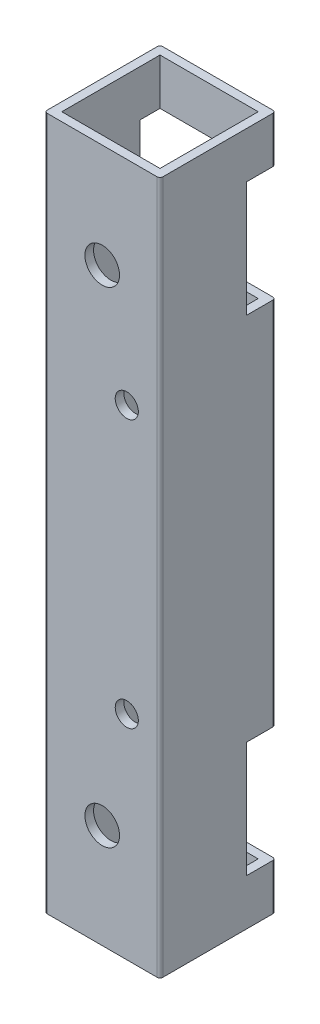
ISO-10303-21;
HEADER;
FILE_DESCRIPTION(('STEP AP214'),'2;1');
FILE_NAME('part.step','',(''),(''),'','','');
FILE_SCHEMA(('AUTOMOTIVE_DESIGN { 1 0 10303 214 1 1 1 1 }'));
ENDSEC;
DATA;
#1=APPLICATION_CONTEXT('core data for automotive mechanical design processes');
#2=APPLICATION_PROTOCOL_DEFINITION('international standard','automotive_design',2000,#1);
#3=PRODUCT_CONTEXT('',#1,'mechanical');
#4=PRODUCT('Part','Part','',(#3));
#5=PRODUCT_RELATED_PRODUCT_CATEGORY('part','',(#4));
#6=PRODUCT_DEFINITION_FORMATION('','',#4);
#7=PRODUCT_DEFINITION_CONTEXT('part definition',#1,'design');
#8=PRODUCT_DEFINITION('design','',#6,#7);
#9=PRODUCT_DEFINITION_SHAPE('','',#8);
#10=(LENGTH_UNIT() NAMED_UNIT(*) SI_UNIT(.MILLI.,.METRE.));
#11=(NAMED_UNIT(*) PLANE_ANGLE_UNIT() SI_UNIT($,.RADIAN.));
#12=(NAMED_UNIT(*) SI_UNIT($,.STERADIAN.) SOLID_ANGLE_UNIT());
#13=UNCERTAINTY_MEASURE_WITH_UNIT(LENGTH_MEASURE(1.E-05),#10,'distance_accuracy_value','');
#14=(GEOMETRIC_REPRESENTATION_CONTEXT(3) GLOBAL_UNCERTAINTY_ASSIGNED_CONTEXT((#13)) GLOBAL_UNIT_ASSIGNED_CONTEXT((#10,
#11,#12)) REPRESENTATION_CONTEXT('',''));
#15=CARTESIAN_POINT('',(0.,0.,0.));
#16=DIRECTION('',(0.,0.,1.));
#17=DIRECTION('',(1.,0.,0.));
#18=AXIS2_PLACEMENT_3D('',#15,#16,#17);
#19=CARTESIAN_POINT('',(19.5,120.,-19.5));
#20=DIRECTION('',(0.,-1.,0.));
#21=DIRECTION('',(0.,0.,-1.));
#22=AXIS2_PLACEMENT_3D('',#19,#20,#21);
#23=CYLINDRICAL_SURFACE('',#22,0.5);
#24=DIRECTION('',(0.,-1.,0.));
#25=VECTOR('',#24,1.);
#26=CARTESIAN_POINT('',(19.5,120.,-20.));
#27=LINE('',#26,#25);
#28=CARTESIAN_POINT('',(19.5,92.,-20.));
#29=VERTEX_POINT('',#28);
#30=CARTESIAN_POINT('',(19.5,28.,-20.));
#31=VERTEX_POINT('',#30);
#32=EDGE_CURVE('E530',#29,#31,#27,.T.);
#33=ORIENTED_EDGE('',*,*,#32,.F.);
#34=CARTESIAN_POINT('',(19.5,92.,-19.5));
#35=DIRECTION('',(0.,-1.,0.));
#36=DIRECTION('',(0.,0.,-1.));
#37=AXIS2_PLACEMENT_3D('',#34,#35,#36);
#38=CIRCLE('',#37,0.5);
#39=CARTESIAN_POINT('',(20.,92.,-19.5));
#40=VERTEX_POINT('',#39);
#41=EDGE_CURVE('E390',#29,#40,#38,.T.);
#42=ORIENTED_EDGE('',*,*,#41,.T.);
#43=DIRECTION('',(0.,-1.,0.));
#44=VECTOR('',#43,1.);
#45=CARTESIAN_POINT('',(20.,120.,-19.5));
#46=LINE('',#45,#44);
#47=CARTESIAN_POINT('',(20.,28.,-19.5));
#48=VERTEX_POINT('',#47);
#49=EDGE_CURVE('E536',#40,#48,#46,.T.);
#50=ORIENTED_EDGE('',*,*,#49,.T.);
#51=CARTESIAN_POINT('',(19.5,28.,-19.5));
#52=DIRECTION('',(0.,1.,0.));
#53=DIRECTION('',(0.,0.,1.));
#54=AXIS2_PLACEMENT_3D('',#51,#52,#53);
#55=CIRCLE('',#54,0.5);
#56=EDGE_CURVE('E350',#48,#31,#55,.T.);
#57=ORIENTED_EDGE('',*,*,#56,.T.);
#58=EDGE_LOOP('',(#33,#42,#50,#57));
#59=FACE_BOUND('',#58,.T.);
#60=ADVANCED_FACE('F39',(#59),#23,.T.);
#61=CARTESIAN_POINT('',(19.5,8.00000000000001,-20.));
#62=VERTEX_POINT('',#61);
#63=CARTESIAN_POINT('',(19.5,0.,-20.));
#64=VERTEX_POINT('',#63);
#65=EDGE_CURVE('E523',#62,#64,#27,.T.);
#66=ORIENTED_EDGE('',*,*,#65,.F.);
#67=CARTESIAN_POINT('',(19.5,8.00000000000001,-19.5));
#68=DIRECTION('',(0.,-1.,0.));
#69=DIRECTION('',(0.,0.,-1.));
#70=AXIS2_PLACEMENT_3D('',#67,#68,#69);
#71=CIRCLE('',#70,0.5);
#72=CARTESIAN_POINT('',(20.,8.00000000000001,-19.5));
#73=VERTEX_POINT('',#72);
#74=EDGE_CURVE('E364',#62,#73,#71,.T.);
#75=ORIENTED_EDGE('',*,*,#74,.T.);
#76=CARTESIAN_POINT('',(20.,0.,-19.5));
#77=VERTEX_POINT('',#76);
#78=EDGE_CURVE('E529',#73,#77,#46,.T.);
#79=ORIENTED_EDGE('',*,*,#78,.T.);
#80=CARTESIAN_POINT('',(19.5,0.,-19.5));
#81=DIRECTION('',(0.,1.,0.));
#82=DIRECTION('',(0.,0.,-1.));
#83=AXIS2_PLACEMENT_3D('',#80,#81,#82);
#84=CIRCLE('',#83,0.5);
#85=EDGE_CURVE('E482',#77,#64,#84,.T.);
#86=ORIENTED_EDGE('',*,*,#85,.T.);
#87=EDGE_LOOP('',(#66,#75,#79,#86));
#88=FACE_BOUND('',#87,.T.);
#89=ADVANCED_FACE('F637',(#88),#23,.T.);
#90=CARTESIAN_POINT('',(0.5,120.,-20.));
#91=DIRECTION('',(0.,0.,1.));
#92=DIRECTION('',(1.,0.,0.));
#93=AXIS2_PLACEMENT_3D('',#90,#91,#92);
#94=PLANE('',#93);
#95=DIRECTION('',(0.,-1.,0.));
#96=VECTOR('',#95,1.);
#97=CARTESIAN_POINT('',(0.5,120.,-20.));
#98=LINE('',#97,#96);
#99=CARTESIAN_POINT('',(0.5,92.,-20.));
#100=VERTEX_POINT('',#99);
#101=CARTESIAN_POINT('',(0.5,28.,-20.));
#102=VERTEX_POINT('',#101);
#103=EDGE_CURVE('E524',#100,#102,#98,.T.);
#104=ORIENTED_EDGE('',*,*,#103,.F.);
#105=DIRECTION('',(1.,0.,0.));
#106=VECTOR('',#105,1.);
#107=CARTESIAN_POINT('',(0.,92.,-20.));
#108=LINE('',#107,#106);
#109=EDGE_CURVE('E258',#100,#29,#108,.T.);
#110=ORIENTED_EDGE('',*,*,#109,.T.);
#111=ORIENTED_EDGE('',*,*,#32,.T.);
#112=DIRECTION('',(1.,0.,0.));
#113=VECTOR('',#112,1.);
#114=CARTESIAN_POINT('',(0.,28.,-20.));
#115=LINE('',#114,#113);
#116=EDGE_CURVE('E335',#102,#31,#115,.T.);
#117=ORIENTED_EDGE('',*,*,#116,.F.);
#118=EDGE_LOOP('',(#104,#110,#111,#117));
#119=FACE_BOUND('',#118,.T.);
#120=ADVANCED_FACE('F657',(#119),#94,.F.);
#121=CARTESIAN_POINT('',(0.5,8.00000000000001,-20.));
#122=VERTEX_POINT('',#121);
#123=CARTESIAN_POINT('',(0.5,0.,-20.));
#124=VERTEX_POINT('',#123);
#125=EDGE_CURVE('E517',#122,#124,#98,.T.);
#126=ORIENTED_EDGE('',*,*,#125,.F.);
#127=DIRECTION('',(1.,0.,0.));
#128=VECTOR('',#127,1.);
#129=CARTESIAN_POINT('',(0.,8.00000000000001,-20.));
#130=LINE('',#129,#128);
#131=EDGE_CURVE('E315',#122,#62,#130,.T.);
#132=ORIENTED_EDGE('',*,*,#131,.T.);
#133=ORIENTED_EDGE('',*,*,#65,.T.);
#134=DIRECTION('',(-1.,0.,0.));
#135=VECTOR('',#134,1.);
#136=CARTESIAN_POINT('',(0.5,0.,-20.));
#137=LINE('',#136,#135);
#138=EDGE_CURVE('E486',#64,#124,#137,.T.);
#139=ORIENTED_EDGE('',*,*,#138,.T.);
#140=EDGE_LOOP('',(#126,#132,#133,#139));
#141=FACE_BOUND('',#140,.T.);
#142=ADVANCED_FACE('F633',(#141),#94,.F.);
#143=CARTESIAN_POINT('',(0.5,120.,-19.5));
#144=DIRECTION('',(0.,-1.,0.));
#145=DIRECTION('',(0.,0.,-1.));
#146=AXIS2_PLACEMENT_3D('',#143,#144,#145);
#147=CYLINDRICAL_SURFACE('',#146,0.5);
#148=DIRECTION('',(0.,-1.,0.));
#149=VECTOR('',#148,1.);
#150=CARTESIAN_POINT('',(0.,120.,-19.5));
#151=LINE('',#150,#149);
#152=CARTESIAN_POINT('',(0.,92.,-19.5));
#153=VERTEX_POINT('',#152);
#154=CARTESIAN_POINT('',(0.,28.,-19.5));
#155=VERTEX_POINT('',#154);
#156=EDGE_CURVE('E518',#153,#155,#151,.T.);
#157=ORIENTED_EDGE('',*,*,#156,.F.);
#158=CARTESIAN_POINT('',(0.5,92.,-19.5));
#159=DIRECTION('',(0.,-1.,0.));
#160=DIRECTION('',(0.,0.,-1.));
#161=AXIS2_PLACEMENT_3D('',#158,#159,#160);
#162=CIRCLE('',#161,0.5);
#163=EDGE_CURVE('E265',#153,#100,#162,.T.);
#164=ORIENTED_EDGE('',*,*,#163,.T.);
#165=ORIENTED_EDGE('',*,*,#103,.T.);
#166=CARTESIAN_POINT('',(0.5,28.,-19.5));
#167=DIRECTION('',(0.,1.,0.));
#168=DIRECTION('',(0.,0.,1.));
#169=AXIS2_PLACEMENT_3D('',#166,#167,#168);
#170=CIRCLE('',#169,0.5);
#171=EDGE_CURVE('E346',#102,#155,#170,.T.);
#172=ORIENTED_EDGE('',*,*,#171,.T.);
#173=EDGE_LOOP('',(#157,#164,#165,#172));
#174=FACE_BOUND('',#173,.T.);
#175=ADVANCED_FACE('F659',(#174),#147,.T.);
#176=CARTESIAN_POINT('',(0.,8.00000000000001,-19.5));
#177=VERTEX_POINT('',#176);
#178=CARTESIAN_POINT('',(0.,0.,-19.5));
#179=VERTEX_POINT('',#178);
#180=EDGE_CURVE('E513',#177,#179,#151,.T.);
#181=ORIENTED_EDGE('',*,*,#180,.F.);
#182=CARTESIAN_POINT('',(0.5,8.00000000000001,-19.5));
#183=DIRECTION('',(0.,-1.,0.));
#184=DIRECTION('',(0.,0.,-1.));
#185=AXIS2_PLACEMENT_3D('',#182,#183,#184);
#186=CIRCLE('',#185,0.5);
#187=EDGE_CURVE('E360',#177,#122,#186,.T.);
#188=ORIENTED_EDGE('',*,*,#187,.T.);
#189=ORIENTED_EDGE('',*,*,#125,.T.);
#190=CARTESIAN_POINT('',(0.5,0.,-19.5));
#191=DIRECTION('',(0.,1.,0.));
#192=DIRECTION('',(0.,0.,-1.));
#193=AXIS2_PLACEMENT_3D('',#190,#191,#192);
#194=CIRCLE('',#193,0.5);
#195=EDGE_CURVE('E490',#124,#179,#194,.T.);
#196=ORIENTED_EDGE('',*,*,#195,.T.);
#197=EDGE_LOOP('',(#181,#188,#189,#196));
#198=FACE_BOUND('',#197,.T.);
#199=ADVANCED_FACE('F629',(#198),#147,.T.);
#200=CARTESIAN_POINT('',(1.5,120.,-18.5));
#201=DIRECTION('',(0.,0.,1.));
#202=DIRECTION('',(1.,0.,0.));
#203=AXIS2_PLACEMENT_3D('',#200,#201,#202);
#204=PLANE('',#203);
#205=DIRECTION('',(1.,0.,0.));
#206=VECTOR('',#205,1.);
#207=CARTESIAN_POINT('',(1.5,92.,-18.5));
#208=LINE('',#207,#206);
#209=CARTESIAN_POINT('',(1.5,92.,-18.5));
#210=VERTEX_POINT('',#209);
#211=CARTESIAN_POINT('',(18.5,92.,-18.5));
#212=VERTEX_POINT('',#211);
#213=EDGE_CURVE('E549',#210,#212,#208,.T.);
#214=ORIENTED_EDGE('',*,*,#213,.F.);
#215=DIRECTION('',(0.,-1.,0.));
#216=VECTOR('',#215,1.);
#217=CARTESIAN_POINT('',(1.5,120.,-18.5));
#218=LINE('',#217,#216);
#219=CARTESIAN_POINT('',(1.5,28.,-18.5));
#220=VERTEX_POINT('',#219);
#221=EDGE_CURVE('E434',#210,#220,#218,.T.);
#222=ORIENTED_EDGE('',*,*,#221,.T.);
#223=DIRECTION('',(-1.,0.,0.));
#224=VECTOR('',#223,1.);
#225=CARTESIAN_POINT('',(1.5,28.,-18.5));
#226=LINE('',#225,#224);
#227=CARTESIAN_POINT('',(18.5,28.,-18.5));
#228=VERTEX_POINT('',#227);
#229=EDGE_CURVE('E540',#228,#220,#226,.T.);
#230=ORIENTED_EDGE('',*,*,#229,.F.);
#231=DIRECTION('',(0.,-1.,0.));
#232=VECTOR('',#231,1.);
#233=CARTESIAN_POINT('',(18.5,120.,-18.5));
#234=LINE('',#233,#232);
#235=EDGE_CURVE('E440',#212,#228,#234,.T.);
#236=ORIENTED_EDGE('',*,*,#235,.F.);
#237=EDGE_LOOP('',(#214,#222,#230,#236));
#238=FACE_BOUND('',#237,.T.);
#239=ADVANCED_FACE('F699',(#238),#204,.T.);
#240=DIRECTION('',(1.,0.,0.));
#241=VECTOR('',#240,1.);
#242=CARTESIAN_POINT('',(1.5,8.00000000000001,-18.5));
#243=LINE('',#242,#241);
#244=CARTESIAN_POINT('',(1.5,8.00000000000001,-18.5));
#245=VERTEX_POINT('',#244);
#246=CARTESIAN_POINT('',(18.5,8.00000000000001,-18.5));
#247=VERTEX_POINT('',#246);
#248=EDGE_CURVE('E543',#245,#247,#243,.T.);
#249=ORIENTED_EDGE('',*,*,#248,.F.);
#250=CARTESIAN_POINT('',(1.5,0.,-18.5));
#251=VERTEX_POINT('',#250);
#252=EDGE_CURVE('E414',#245,#251,#218,.T.);
#253=ORIENTED_EDGE('',*,*,#252,.T.);
#254=DIRECTION('',(-1.,0.,0.));
#255=VECTOR('',#254,1.);
#256=CARTESIAN_POINT('',(1.5,0.,-18.5));
#257=LINE('',#256,#255);
#258=CARTESIAN_POINT('',(18.5,0.,-18.5));
#259=VERTEX_POINT('',#258);
#260=EDGE_CURVE('E404',#259,#251,#257,.T.);
#261=ORIENTED_EDGE('',*,*,#260,.F.);
#262=EDGE_CURVE('E433',#247,#259,#234,.T.);
#263=ORIENTED_EDGE('',*,*,#262,.F.);
#264=EDGE_LOOP('',(#249,#253,#261,#263));
#265=FACE_BOUND('',#264,.T.);
#266=ADVANCED_FACE('F725',(#265),#204,.T.);
#267=CARTESIAN_POINT('',(19.5,120.,-0.5));
#268=DIRECTION('',(0.,1.,0.));
#269=DIRECTION('',(0.,0.,1.));
#270=AXIS2_PLACEMENT_3D('',#267,#268,#269);
#271=PLANE('',#270);
#272=CARTESIAN_POINT('',(19.5,120.,-0.5));
#273=DIRECTION('',(0.,1.,0.));
#274=DIRECTION('',(0.,0.,1.));
#275=AXIS2_PLACEMENT_3D('',#272,#273,#274);
#276=CIRCLE('',#275,0.5);
#277=CARTESIAN_POINT('',(19.5,120.,0.));
#278=VERTEX_POINT('',#277);
#279=CARTESIAN_POINT('',(20.,120.,-0.5));
#280=VERTEX_POINT('',#279);
#281=EDGE_CURVE('E448',#278,#280,#276,.T.);
#282=ORIENTED_EDGE('',*,*,#281,.T.);
#283=DIRECTION('',(0.,0.,-1.));
#284=VECTOR('',#283,1.);
#285=CARTESIAN_POINT('',(20.,120.,-0.5));
#286=LINE('',#285,#284);
#287=CARTESIAN_POINT('',(20.,120.,-19.5));
#288=VERTEX_POINT('',#287);
#289=EDGE_CURVE('E452',#280,#288,#286,.T.);
#290=ORIENTED_EDGE('',*,*,#289,.T.);
#291=CARTESIAN_POINT('',(19.5,120.,-19.5));
#292=DIRECTION('',(0.,1.,0.));
#293=DIRECTION('',(0.,0.,-1.));
#294=AXIS2_PLACEMENT_3D('',#291,#292,#293);
#295=CIRCLE('',#294,0.5);
#296=CARTESIAN_POINT('',(19.5,120.,-20.));
#297=VERTEX_POINT('',#296);
#298=EDGE_CURVE('E456',#288,#297,#295,.T.);
#299=ORIENTED_EDGE('',*,*,#298,.T.);
#300=DIRECTION('',(-1.,0.,0.));
#301=VECTOR('',#300,1.);
#302=CARTESIAN_POINT('',(0.5,120.,-20.));
#303=LINE('',#302,#301);
#304=CARTESIAN_POINT('',(0.5,120.,-20.));
#305=VERTEX_POINT('',#304);
#306=EDGE_CURVE('E459',#297,#305,#303,.T.);
#307=ORIENTED_EDGE('',*,*,#306,.T.);
#308=CARTESIAN_POINT('',(0.5,120.,-19.5));
#309=DIRECTION('',(0.,1.,0.));
#310=DIRECTION('',(0.,0.,-1.));
#311=AXIS2_PLACEMENT_3D('',#308,#309,#310);
#312=CIRCLE('',#311,0.5);
#313=CARTESIAN_POINT('',(0.,120.,-19.5));
#314=VERTEX_POINT('',#313);
#315=EDGE_CURVE('E462',#305,#314,#312,.T.);
#316=ORIENTED_EDGE('',*,*,#315,.T.);
#317=DIRECTION('',(0.,0.,1.));
#318=VECTOR('',#317,1.);
#319=CARTESIAN_POINT('',(0.,120.,-0.500000000000004));
#320=LINE('',#319,#318);
#321=CARTESIAN_POINT('',(0.,120.,-0.500000000000003));
#322=VERTEX_POINT('',#321);
#323=EDGE_CURVE('E465',#314,#322,#320,.T.);
#324=ORIENTED_EDGE('',*,*,#323,.T.);
#325=CARTESIAN_POINT('',(0.5,120.,-0.5));
#326=DIRECTION('',(0.,1.,0.));
#327=DIRECTION('',(0.,0.,-1.));
#328=AXIS2_PLACEMENT_3D('',#325,#326,#327);
#329=CIRCLE('',#328,0.5);
#330=CARTESIAN_POINT('',(0.500000000000004,120.,0.));
#331=VERTEX_POINT('',#330);
#332=EDGE_CURVE('E468',#322,#331,#329,.T.);
#333=ORIENTED_EDGE('',*,*,#332,.T.);
#334=DIRECTION('',(1.,0.,0.));
#335=VECTOR('',#334,1.);
#336=CARTESIAN_POINT('',(0.500000000000004,120.,0.));
#337=LINE('',#336,#335);
#338=EDGE_CURVE('E471',#331,#278,#337,.T.);
#339=ORIENTED_EDGE('',*,*,#338,.T.);
#340=EDGE_LOOP('',(#282,#290,#299,#307,#316,#324,#333,#339));
#341=FACE_BOUND('',#340,.T.);
#342=DIRECTION('',(1.,0.,0.));
#343=VECTOR('',#342,1.);
#344=CARTESIAN_POINT('',(1.5,120.,-1.5));
#345=LINE('',#344,#343);
#346=CARTESIAN_POINT('',(1.5,120.,-1.5));
#347=VERTEX_POINT('',#346);
#348=CARTESIAN_POINT('',(18.5,120.,-1.5));
#349=VERTEX_POINT('',#348);
#350=EDGE_CURVE('E403',#347,#349,#345,.T.);
#351=ORIENTED_EDGE('',*,*,#350,.F.);
#352=DIRECTION('',(0.,0.,1.));
#353=VECTOR('',#352,1.);
#354=CARTESIAN_POINT('',(1.5,120.,-1.5));
#355=LINE('',#354,#353);
#356=CARTESIAN_POINT('',(1.5,120.,-18.5));
#357=VERTEX_POINT('',#356);
#358=EDGE_CURVE('E400',#357,#347,#355,.T.);
#359=ORIENTED_EDGE('',*,*,#358,.F.);
#360=DIRECTION('',(-1.,0.,0.));
#361=VECTOR('',#360,1.);
#362=CARTESIAN_POINT('',(1.5,120.,-18.5));
#363=LINE('',#362,#361);
#364=CARTESIAN_POINT('',(18.5,120.,-18.5));
#365=VERTEX_POINT('',#364);
#366=EDGE_CURVE('E411',#365,#357,#363,.T.);
#367=ORIENTED_EDGE('',*,*,#366,.F.);
#368=DIRECTION('',(0.,0.,-1.));
#369=VECTOR('',#368,1.);
#370=CARTESIAN_POINT('',(18.5,120.,-1.5));
#371=LINE('',#370,#369);
#372=EDGE_CURVE('E407',#349,#365,#371,.T.);
#373=ORIENTED_EDGE('',*,*,#372,.F.);
#374=EDGE_LOOP('',(#351,#359,#367,#373));
#375=FACE_BOUND('',#374,.T.);
#376=ADVANCED_FACE('F617',(#341,#375),#271,.T.);
#377=CARTESIAN_POINT('',(19.5,0.,-0.5));
#378=DIRECTION('',(0.,1.,0.));
#379=DIRECTION('',(0.,0.,1.));
#380=AXIS2_PLACEMENT_3D('',#377,#378,#379);
#381=PLANE('',#380);
#382=CARTESIAN_POINT('',(19.5,0.,-0.5));
#383=DIRECTION('',(0.,1.,0.));
#384=DIRECTION('',(0.,0.,1.));
#385=AXIS2_PLACEMENT_3D('',#382,#383,#384);
#386=CIRCLE('',#385,0.5);
#387=CARTESIAN_POINT('',(19.5,0.,0.));
#388=VERTEX_POINT('',#387);
#389=CARTESIAN_POINT('',(20.,0.,-0.5));
#390=VERTEX_POINT('',#389);
#391=EDGE_CURVE('E447',#388,#390,#386,.T.);
#392=ORIENTED_EDGE('',*,*,#391,.F.);
#393=DIRECTION('',(1.,0.,0.));
#394=VECTOR('',#393,1.);
#395=CARTESIAN_POINT('',(0.500000000000004,0.,0.));
#396=LINE('',#395,#394);
#397=CARTESIAN_POINT('',(0.500000000000004,0.,0.));
#398=VERTEX_POINT('',#397);
#399=EDGE_CURVE('E453',#398,#388,#396,.T.);
#400=ORIENTED_EDGE('',*,*,#399,.F.);
#401=CARTESIAN_POINT('',(0.5,0.,-0.5));
#402=DIRECTION('',(0.,1.,0.));
#403=DIRECTION('',(0.,0.,-1.));
#404=AXIS2_PLACEMENT_3D('',#401,#402,#403);
#405=CIRCLE('',#404,0.5);
#406=CARTESIAN_POINT('',(0.,0.,-0.500000000000003));
#407=VERTEX_POINT('',#406);
#408=EDGE_CURVE('E497',#407,#398,#405,.T.);
#409=ORIENTED_EDGE('',*,*,#408,.F.);
#410=DIRECTION('',(0.,0.,1.));
#411=VECTOR('',#410,1.);
#412=CARTESIAN_POINT('',(0.,0.,-0.500000000000004));
#413=LINE('',#412,#411);
#414=EDGE_CURVE('E494',#179,#407,#413,.T.);
#415=ORIENTED_EDGE('',*,*,#414,.F.);
#416=ORIENTED_EDGE('',*,*,#195,.F.);
#417=ORIENTED_EDGE('',*,*,#138,.F.);
#418=ORIENTED_EDGE('',*,*,#85,.F.);
#419=DIRECTION('',(0.,0.,-1.));
#420=VECTOR('',#419,1.);
#421=CARTESIAN_POINT('',(20.,0.,-0.5));
#422=LINE('',#421,#420);
#423=EDGE_CURVE('E478',#390,#77,#422,.T.);
#424=ORIENTED_EDGE('',*,*,#423,.F.);
#425=EDGE_LOOP('',(#392,#400,#409,#415,#416,#417,#418,#424));
#426=FACE_BOUND('',#425,.T.);
#427=DIRECTION('',(0.,0.,1.));
#428=VECTOR('',#427,1.);
#429=CARTESIAN_POINT('',(1.5,0.,-1.5));
#430=LINE('',#429,#428);
#431=CARTESIAN_POINT('',(1.5,0.,-1.5));
#432=VERTEX_POINT('',#431);
#433=EDGE_CURVE('E399',#251,#432,#430,.T.);
#434=ORIENTED_EDGE('',*,*,#433,.T.);
#435=DIRECTION('',(1.,0.,0.));
#436=VECTOR('',#435,1.);
#437=CARTESIAN_POINT('',(1.5,0.,-1.5));
#438=LINE('',#437,#436);
#439=CARTESIAN_POINT('',(18.5,0.,-1.5));
#440=VERTEX_POINT('',#439);
#441=EDGE_CURVE('E418',#432,#440,#438,.T.);
#442=ORIENTED_EDGE('',*,*,#441,.T.);
#443=DIRECTION('',(0.,0.,-1.));
#444=VECTOR('',#443,1.);
#445=CARTESIAN_POINT('',(18.5,0.,-1.5));
#446=LINE('',#445,#444);
#447=EDGE_CURVE('E422',#440,#259,#446,.T.);
#448=ORIENTED_EDGE('',*,*,#447,.T.);
#449=ORIENTED_EDGE('',*,*,#260,.T.);
#450=EDGE_LOOP('',(#434,#442,#448,#449));
#451=FACE_BOUND('',#450,.T.);
#452=ADVANCED_FACE('F605',(#426,#451),#381,.F.);
#453=CARTESIAN_POINT('',(19.5,120.,-0.5));
#454=DIRECTION('',(0.,-1.,0.));
#455=DIRECTION('',(0.,0.,-1.));
#456=AXIS2_PLACEMENT_3D('',#453,#454,#455);
#457=CYLINDRICAL_SURFACE('',#456,0.5);
#458=ORIENTED_EDGE('',*,*,#391,.T.);
#459=DIRECTION('',(0.,-1.,0.));
#460=VECTOR('',#459,1.);
#461=CARTESIAN_POINT('',(20.,120.,-0.5));
#462=LINE('',#461,#460);
#463=EDGE_CURVE('E535',#280,#390,#462,.T.);
#464=ORIENTED_EDGE('',*,*,#463,.F.);
#465=ORIENTED_EDGE('',*,*,#281,.F.);
#466=DIRECTION('',(0.,-1.,0.));
#467=VECTOR('',#466,1.);
#468=CARTESIAN_POINT('',(19.5,120.,0.));
#469=LINE('',#468,#467);
#470=EDGE_CURVE('E474',#278,#388,#469,.T.);
#471=ORIENTED_EDGE('',*,*,#470,.T.);
#472=EDGE_LOOP('',(#458,#464,#465,#471));
#473=FACE_BOUND('',#472,.T.);
#474=ADVANCED_FACE('F41',(#473),#457,.T.);
#475=CARTESIAN_POINT('',(20.,120.,-0.5));
#476=DIRECTION('',(-1.,0.,0.));
#477=DIRECTION('',(0.,0.,1.));
#478=AXIS2_PLACEMENT_3D('',#475,#476,#477);
#479=PLANE('',#478);
#480=ORIENTED_EDGE('',*,*,#49,.F.);
#481=DIRECTION('',(0.,0.,-1.));
#482=VECTOR('',#481,1.);
#483=CARTESIAN_POINT('',(20.,92.,-15.));
#484=LINE('',#483,#482);
#485=CARTESIAN_POINT('',(20.,92.,-15.));
#486=VERTEX_POINT('',#485);
#487=EDGE_CURVE('E279',#486,#40,#484,.T.);
#488=ORIENTED_EDGE('',*,*,#487,.F.);
#489=DIRECTION('',(0.,-1.,0.));
#490=VECTOR('',#489,1.);
#491=CARTESIAN_POINT('',(20.,112.,-15.));
#492=LINE('',#491,#490);
#493=CARTESIAN_POINT('',(20.,112.,-15.));
#494=VERTEX_POINT('',#493);
#495=EDGE_CURVE('E287',#494,#486,#492,.T.);
#496=ORIENTED_EDGE('',*,*,#495,.F.);
#497=DIRECTION('',(0.,0.,1.));
#498=VECTOR('',#497,1.);
#499=CARTESIAN_POINT('',(20.,112.,-20.));
#500=LINE('',#499,#498);
#501=CARTESIAN_POINT('',(20.,112.,-19.5));
#502=VERTEX_POINT('',#501);
#503=EDGE_CURVE('E283',#502,#494,#500,.T.);
#504=ORIENTED_EDGE('',*,*,#503,.F.);
#505=EDGE_CURVE('E531',#288,#502,#46,.T.);
#506=ORIENTED_EDGE('',*,*,#505,.F.);
#507=ORIENTED_EDGE('',*,*,#289,.F.);
#508=ORIENTED_EDGE('',*,*,#463,.T.);
#509=ORIENTED_EDGE('',*,*,#423,.T.);
#510=ORIENTED_EDGE('',*,*,#78,.F.);
#511=DIRECTION('',(0.,0.,-1.));
#512=VECTOR('',#511,1.);
#513=CARTESIAN_POINT('',(20.,8.00000000000001,-15.));
#514=LINE('',#513,#512);
#515=CARTESIAN_POINT('',(20.,8.00000000000001,-15.));
#516=VERTEX_POINT('',#515);
#517=EDGE_CURVE('E316',#516,#73,#514,.T.);
#518=ORIENTED_EDGE('',*,*,#517,.F.);
#519=DIRECTION('',(0.,-1.,0.));
#520=VECTOR('',#519,1.);
#521=CARTESIAN_POINT('',(20.,8.00000000000001,-15.));
#522=LINE('',#521,#520);
#523=CARTESIAN_POINT('',(20.,28.,-15.));
#524=VERTEX_POINT('',#523);
#525=EDGE_CURVE('E309',#524,#516,#522,.T.);
#526=ORIENTED_EDGE('',*,*,#525,.F.);
#527=DIRECTION('',(0.,0.,1.));
#528=VECTOR('',#527,1.);
#529=CARTESIAN_POINT('',(20.,28.,-15.));
#530=LINE('',#529,#528);
#531=EDGE_CURVE('E319',#48,#524,#530,.T.);
#532=ORIENTED_EDGE('',*,*,#531,.F.);
#533=EDGE_LOOP('',(#480,#488,#496,#504,#506,#507,#508,#509,#510,#518,#526,#532));
#534=FACE_BOUND('',#533,.T.);
#535=ADVANCED_FACE('F612',(#534),#479,.F.);
#536=ORIENTED_EDGE('',*,*,#505,.T.);
#537=CARTESIAN_POINT('',(19.5,112.,-19.5));
#538=DIRECTION('',(0.,1.,0.));
#539=DIRECTION('',(0.,0.,1.));
#540=AXIS2_PLACEMENT_3D('',#537,#538,#539);
#541=CIRCLE('',#540,0.5);
#542=CARTESIAN_POINT('',(19.5,112.,-20.));
#543=VERTEX_POINT('',#542);
#544=EDGE_CURVE('E378',#502,#543,#541,.T.);
#545=ORIENTED_EDGE('',*,*,#544,.T.);
#546=EDGE_CURVE('E525',#297,#543,#27,.T.);
#547=ORIENTED_EDGE('',*,*,#546,.F.);
#548=ORIENTED_EDGE('',*,*,#298,.F.);
#549=EDGE_LOOP('',(#536,#545,#547,#548));
#550=FACE_BOUND('',#549,.T.);
#551=ADVANCED_FACE('F679',(#550),#23,.T.);
#552=ORIENTED_EDGE('',*,*,#546,.T.);
#553=DIRECTION('',(1.,0.,0.));
#554=VECTOR('',#553,1.);
#555=CARTESIAN_POINT('',(0.,112.,-20.));
#556=LINE('',#555,#554);
#557=CARTESIAN_POINT('',(0.5,112.,-20.));
#558=VERTEX_POINT('',#557);
#559=EDGE_CURVE('E270',#558,#543,#556,.T.);
#560=ORIENTED_EDGE('',*,*,#559,.F.);
#561=EDGE_CURVE('E519',#305,#558,#98,.T.);
#562=ORIENTED_EDGE('',*,*,#561,.F.);
#563=ORIENTED_EDGE('',*,*,#306,.F.);
#564=EDGE_LOOP('',(#552,#560,#562,#563));
#565=FACE_BOUND('',#564,.T.);
#566=ADVANCED_FACE('F687',(#565),#94,.F.);
#567=ORIENTED_EDGE('',*,*,#561,.T.);
#568=CARTESIAN_POINT('',(0.5,112.,-19.5));
#569=DIRECTION('',(0.,1.,0.));
#570=DIRECTION('',(0.,0.,1.));
#571=AXIS2_PLACEMENT_3D('',#568,#569,#570);
#572=CIRCLE('',#571,0.5);
#573=CARTESIAN_POINT('',(0.,112.,-19.5));
#574=VERTEX_POINT('',#573);
#575=EDGE_CURVE('E374',#558,#574,#572,.T.);
#576=ORIENTED_EDGE('',*,*,#575,.T.);
#577=EDGE_CURVE('E514',#314,#574,#151,.T.);
#578=ORIENTED_EDGE('',*,*,#577,.F.);
#579=ORIENTED_EDGE('',*,*,#315,.F.);
#580=EDGE_LOOP('',(#567,#576,#578,#579));
#581=FACE_BOUND('',#580,.T.);
#582=ADVANCED_FACE('F689',(#581),#147,.T.);
#583=CARTESIAN_POINT('',(0.,120.,-0.500000000000004));
#584=DIRECTION('',(1.,0.,0.));
#585=DIRECTION('',(0.,0.,-1.));
#586=AXIS2_PLACEMENT_3D('',#583,#584,#585);
#587=PLANE('',#586);
#588=DIRECTION('',(0.,-1.,0.));
#589=VECTOR('',#588,1.);
#590=CARTESIAN_POINT('',(0.,112.,-15.));
#591=LINE('',#590,#589);
#592=CARTESIAN_POINT('',(0.,112.,-15.));
#593=VERTEX_POINT('',#592);
#594=CARTESIAN_POINT('',(0.,92.,-15.));
#595=VERTEX_POINT('',#594);
#596=EDGE_CURVE('E57',#593,#595,#591,.T.);
#597=ORIENTED_EDGE('',*,*,#596,.T.);
#598=DIRECTION('',(0.,0.,-1.));
#599=VECTOR('',#598,1.);
#600=CARTESIAN_POINT('',(0.,92.,-15.));
#601=LINE('',#600,#599);
#602=EDGE_CURVE('E262',#595,#153,#601,.T.);
#603=ORIENTED_EDGE('',*,*,#602,.T.);
#604=ORIENTED_EDGE('',*,*,#156,.T.);
#605=DIRECTION('',(0.,0.,1.));
#606=VECTOR('',#605,1.);
#607=CARTESIAN_POINT('',(0.,28.,-15.));
#608=LINE('',#607,#606);
#609=CARTESIAN_POINT('',(0.,28.,-15.));
#610=VERTEX_POINT('',#609);
#611=EDGE_CURVE('E308',#155,#610,#608,.T.);
#612=ORIENTED_EDGE('',*,*,#611,.T.);
#613=DIRECTION('',(0.,-1.,0.));
#614=VECTOR('',#613,1.);
#615=CARTESIAN_POINT('',(0.,8.00000000000001,-15.));
#616=LINE('',#615,#614);
#617=CARTESIAN_POINT('',(0.,8.00000000000001,-15.));
#618=VERTEX_POINT('',#617);
#619=EDGE_CURVE('E65',#610,#618,#616,.T.);
#620=ORIENTED_EDGE('',*,*,#619,.T.);
#621=DIRECTION('',(0.,0.,-1.));
#622=VECTOR('',#621,1.);
#623=CARTESIAN_POINT('',(0.,8.00000000000001,-15.));
#624=LINE('',#623,#622);
#625=EDGE_CURVE('E304',#618,#177,#624,.T.);
#626=ORIENTED_EDGE('',*,*,#625,.T.);
#627=ORIENTED_EDGE('',*,*,#180,.T.);
#628=ORIENTED_EDGE('',*,*,#414,.T.);
#629=DIRECTION('',(0.,-1.,0.));
#630=VECTOR('',#629,1.);
#631=CARTESIAN_POINT('',(0.,120.,-0.500000000000003));
#632=LINE('',#631,#630);
#633=EDGE_CURVE('E509',#322,#407,#632,.T.);
#634=ORIENTED_EDGE('',*,*,#633,.F.);
#635=ORIENTED_EDGE('',*,*,#323,.F.);
#636=ORIENTED_EDGE('',*,*,#577,.T.);
#637=DIRECTION('',(0.,0.,1.));
#638=VECTOR('',#637,1.);
#639=CARTESIAN_POINT('',(0.,112.,-20.));
#640=LINE('',#639,#638);
#641=EDGE_CURVE('E275',#574,#593,#640,.T.);
#642=ORIENTED_EDGE('',*,*,#641,.T.);
#643=EDGE_LOOP('',(#597,#603,#604,#612,#620,#626,#627,#628,#634,#635,#636,#642));
#644=FACE_BOUND('',#643,.T.);
#645=ADVANCED_FACE('F273',(#644),#587,.F.);
#646=CARTESIAN_POINT('',(0.5,120.,-0.5));
#647=DIRECTION('',(0.,-1.,0.));
#648=DIRECTION('',(0.,0.,-1.));
#649=AXIS2_PLACEMENT_3D('',#646,#647,#648);
#650=CYLINDRICAL_SURFACE('',#649,0.5);
#651=ORIENTED_EDGE('',*,*,#408,.T.);
#652=DIRECTION('',(0.,-1.,0.));
#653=VECTOR('',#652,1.);
#654=CARTESIAN_POINT('',(0.500000000000004,120.,0.));
#655=LINE('',#654,#653);
#656=EDGE_CURVE('E505',#331,#398,#655,.T.);
#657=ORIENTED_EDGE('',*,*,#656,.F.);
#658=ORIENTED_EDGE('',*,*,#332,.F.);
#659=ORIENTED_EDGE('',*,*,#633,.T.);
#660=EDGE_LOOP('',(#651,#657,#658,#659));
#661=FACE_BOUND('',#660,.T.);
#662=ADVANCED_FACE('F592',(#661),#650,.T.);
#663=CARTESIAN_POINT('',(0.500000000000004,120.,0.));
#664=DIRECTION('',(0.,0.,-1.));
#665=DIRECTION('',(-1.,0.,0.));
#666=AXIS2_PLACEMENT_3D('',#663,#664,#665);
#667=PLANE('',#666);
#668=CARTESIAN_POINT('',(14.25,83.15,0.));
#669=DIRECTION('',(0.,0.,1.));
#670=DIRECTION('',(1.,0.,0.));
#671=AXIS2_PLACEMENT_3D('',#668,#669,#670);
#672=CIRCLE('',#671,2.);
#673=CARTESIAN_POINT('',(16.25,83.15,0.));
#674=VERTEX_POINT('',#673);
#675=EDGE_CURVE('E564',#674,#674,#672,.T.);
#676=ORIENTED_EDGE('',*,*,#675,.F.);
#677=EDGE_LOOP('',(#676));
#678=FACE_BOUND('',#677,.T.);
#679=CARTESIAN_POINT('',(14.25,36.85,0.));
#680=DIRECTION('',(0.,0.,1.));
#681=DIRECTION('',(-1.,0.,0.));
#682=AXIS2_PLACEMENT_3D('',#679,#680,#681);
#683=CIRCLE('',#682,2.);
#684=CARTESIAN_POINT('',(12.25,36.85,0.));
#685=VERTEX_POINT('',#684);
#686=EDGE_CURVE('E572',#685,#685,#683,.T.);
#687=ORIENTED_EDGE('',*,*,#686,.F.);
#688=EDGE_LOOP('',(#687));
#689=FACE_BOUND('',#688,.T.);
#690=CARTESIAN_POINT('',(10.,102.,0.));
#691=DIRECTION('',(0.,0.,1.));
#692=DIRECTION('',(1.,0.,0.));
#693=AXIS2_PLACEMENT_3D('',#690,#691,#692);
#694=CIRCLE('',#693,3.);
#695=CARTESIAN_POINT('',(13.,102.,0.));
#696=VERTEX_POINT('',#695);
#697=EDGE_CURVE('E558',#696,#696,#694,.T.);
#698=ORIENTED_EDGE('',*,*,#697,.F.);
#699=EDGE_LOOP('',(#698));
#700=FACE_BOUND('',#699,.T.);
#701=CARTESIAN_POINT('',(10.,18.,0.));
#702=DIRECTION('',(0.,0.,1.));
#703=DIRECTION('',(1.,0.,0.));
#704=AXIS2_PLACEMENT_3D('',#701,#702,#703);
#705=CIRCLE('',#704,3.);
#706=CARTESIAN_POINT('',(13.,18.,0.));
#707=VERTEX_POINT('',#706);
#708=EDGE_CURVE('E570',#707,#707,#705,.T.);
#709=ORIENTED_EDGE('',*,*,#708,.F.);
#710=EDGE_LOOP('',(#709));
#711=FACE_BOUND('',#710,.T.);
#712=ORIENTED_EDGE('',*,*,#399,.T.);
#713=ORIENTED_EDGE('',*,*,#470,.F.);
#714=ORIENTED_EDGE('',*,*,#338,.F.);
#715=ORIENTED_EDGE('',*,*,#656,.T.);
#716=EDGE_LOOP('',(#712,#713,#714,#715));
#717=FACE_BOUND('',#716,.T.);
#718=ADVANCED_FACE('F588',(#678,#689,#700,#711,#717),#667,.F.);
#719=CARTESIAN_POINT('',(1.5,120.,-1.5));
#720=DIRECTION('',(1.,0.,0.));
#721=DIRECTION('',(0.,0.,-1.));
#722=AXIS2_PLACEMENT_3D('',#719,#720,#721);
#723=PLANE('',#722);
#724=DIRECTION('',(0.,0.,-1.));
#725=VECTOR('',#724,1.);
#726=CARTESIAN_POINT('',(1.5,92.,-1.5));
#727=LINE('',#726,#725);
#728=CARTESIAN_POINT('',(1.5,92.,-15.));
#729=VERTEX_POINT('',#728);
#730=EDGE_CURVE('E385',#729,#210,#727,.T.);
#731=ORIENTED_EDGE('',*,*,#730,.F.);
#732=DIRECTION('',(0.,-1.,0.));
#733=VECTOR('',#732,1.);
#734=CARTESIAN_POINT('',(1.5,120.,-15.));
#735=LINE('',#734,#733);
#736=CARTESIAN_POINT('',(1.5,112.,-15.));
#737=VERTEX_POINT('',#736);
#738=EDGE_CURVE('E254',#737,#729,#735,.T.);
#739=ORIENTED_EDGE('',*,*,#738,.F.);
#740=DIRECTION('',(0.,0.,1.));
#741=VECTOR('',#740,1.);
#742=CARTESIAN_POINT('',(1.5,112.,-1.5));
#743=LINE('',#742,#741);
#744=CARTESIAN_POINT('',(1.5,112.,-18.5));
#745=VERTEX_POINT('',#744);
#746=EDGE_CURVE('E371',#745,#737,#743,.T.);
#747=ORIENTED_EDGE('',*,*,#746,.F.);
#748=EDGE_CURVE('E429',#357,#745,#218,.T.);
#749=ORIENTED_EDGE('',*,*,#748,.F.);
#750=ORIENTED_EDGE('',*,*,#358,.T.);
#751=DIRECTION('',(0.,-1.,0.));
#752=VECTOR('',#751,1.);
#753=CARTESIAN_POINT('',(1.5,120.,-1.5));
#754=LINE('',#753,#752);
#755=EDGE_CURVE('E443',#347,#432,#754,.T.);
#756=ORIENTED_EDGE('',*,*,#755,.T.);
#757=ORIENTED_EDGE('',*,*,#433,.F.);
#758=ORIENTED_EDGE('',*,*,#252,.F.);
#759=DIRECTION('',(0.,0.,-1.));
#760=VECTOR('',#759,1.);
#761=CARTESIAN_POINT('',(1.5,8.00000000000001,-1.5));
#762=LINE('',#761,#760);
#763=CARTESIAN_POINT('',(1.5,8.00000000000001,-15.));
#764=VERTEX_POINT('',#763);
#765=EDGE_CURVE('E357',#764,#245,#762,.T.);
#766=ORIENTED_EDGE('',*,*,#765,.F.);
#767=DIRECTION('',(0.,-1.,0.));
#768=VECTOR('',#767,1.);
#769=CARTESIAN_POINT('',(1.5,120.,-15.));
#770=LINE('',#769,#768);
#771=CARTESIAN_POINT('',(1.5,28.,-15.));
#772=VERTEX_POINT('',#771);
#773=EDGE_CURVE('E394',#772,#764,#770,.T.);
#774=ORIENTED_EDGE('',*,*,#773,.F.);
#775=DIRECTION('',(0.,0.,1.));
#776=VECTOR('',#775,1.);
#777=CARTESIAN_POINT('',(1.5,28.,-1.5));
#778=LINE('',#777,#776);
#779=EDGE_CURVE('E343',#220,#772,#778,.T.);
#780=ORIENTED_EDGE('',*,*,#779,.F.);
#781=ORIENTED_EDGE('',*,*,#221,.F.);
#782=EDGE_LOOP('',(#731,#739,#747,#749,#750,#756,#757,#758,#766,#774,#780,#781));
#783=FACE_BOUND('',#782,.T.);
#784=ADVANCED_FACE('F591',(#783),#723,.T.);
#785=CARTESIAN_POINT('',(1.5,120.,-1.5));
#786=DIRECTION('',(0.,0.,-1.));
#787=DIRECTION('',(-1.,0.,0.));
#788=AXIS2_PLACEMENT_3D('',#785,#786,#787);
#789=PLANE('',#788);
#790=CARTESIAN_POINT('',(14.25,83.15,-1.5));
#791=DIRECTION('',(0.,0.,-1.));
#792=DIRECTION('',(-1.,0.,0.));
#793=AXIS2_PLACEMENT_3D('',#790,#791,#792);
#794=CIRCLE('',#793,2.);
#795=CARTESIAN_POINT('',(12.25,83.15,-1.5));
#796=VERTEX_POINT('',#795);
#797=EDGE_CURVE('E43',#796,#796,#794,.T.);
#798=ORIENTED_EDGE('',*,*,#797,.F.);
#799=EDGE_LOOP('',(#798));
#800=FACE_BOUND('',#799,.T.);
#801=CARTESIAN_POINT('',(14.25,36.85,-1.5));
#802=DIRECTION('',(0.,0.,-1.));
#803=DIRECTION('',(-1.,0.,0.));
#804=AXIS2_PLACEMENT_3D('',#801,#802,#803);
#805=CIRCLE('',#804,2.);
#806=CARTESIAN_POINT('',(12.25,36.85,-1.5));
#807=VERTEX_POINT('',#806);
#808=EDGE_CURVE('E561',#807,#807,#805,.T.);
#809=ORIENTED_EDGE('',*,*,#808,.F.);
#810=EDGE_LOOP('',(#809));
#811=FACE_BOUND('',#810,.T.);
#812=CARTESIAN_POINT('',(10.,102.,-1.5));
#813=DIRECTION('',(0.,0.,-1.));
#814=DIRECTION('',(-1.,0.,0.));
#815=AXIS2_PLACEMENT_3D('',#812,#813,#814);
#816=CIRCLE('',#815,3.);
#817=CARTESIAN_POINT('',(7.,102.,-1.5));
#818=VERTEX_POINT('',#817);
#819=EDGE_CURVE('E320',#818,#818,#816,.T.);
#820=ORIENTED_EDGE('',*,*,#819,.F.);
#821=EDGE_LOOP('',(#820));
#822=FACE_BOUND('',#821,.T.);
#823=CARTESIAN_POINT('',(10.,18.,-1.5));
#824=DIRECTION('',(0.,0.,-1.));
#825=DIRECTION('',(-1.,0.,0.));
#826=AXIS2_PLACEMENT_3D('',#823,#824,#825);
#827=CIRCLE('',#826,3.);
#828=CARTESIAN_POINT('',(7.00000000000001,18.,-1.5));
#829=VERTEX_POINT('',#828);
#830=EDGE_CURVE('E554',#829,#829,#827,.T.);
#831=ORIENTED_EDGE('',*,*,#830,.F.);
#832=EDGE_LOOP('',(#831));
#833=FACE_BOUND('',#832,.T.);
#834=ORIENTED_EDGE('',*,*,#441,.F.);
#835=ORIENTED_EDGE('',*,*,#755,.F.);
#836=ORIENTED_EDGE('',*,*,#350,.T.);
#837=DIRECTION('',(0.,-1.,0.));
#838=VECTOR('',#837,1.);
#839=CARTESIAN_POINT('',(18.5,120.,-1.5));
#840=LINE('',#839,#838);
#841=EDGE_CURVE('E439',#349,#440,#840,.T.);
#842=ORIENTED_EDGE('',*,*,#841,.T.);
#843=EDGE_LOOP('',(#834,#835,#836,#842));
#844=FACE_BOUND('',#843,.T.);
#845=ADVANCED_FACE('F715',(#800,#811,#822,#833,#844),#789,.T.);
#846=CARTESIAN_POINT('',(18.5,120.,-1.5));
#847=DIRECTION('',(-1.,0.,0.));
#848=DIRECTION('',(0.,0.,1.));
#849=AXIS2_PLACEMENT_3D('',#846,#847,#848);
#850=PLANE('',#849);
#851=DIRECTION('',(0.,0.,1.));
#852=VECTOR('',#851,1.);
#853=CARTESIAN_POINT('',(18.5,92.,-1.5));
#854=LINE('',#853,#852);
#855=CARTESIAN_POINT('',(18.5,92.,-15.));
#856=VERTEX_POINT('',#855);
#857=EDGE_CURVE('E382',#212,#856,#854,.T.);
#858=ORIENTED_EDGE('',*,*,#857,.F.);
#859=ORIENTED_EDGE('',*,*,#235,.T.);
#860=DIRECTION('',(0.,0.,-1.));
#861=VECTOR('',#860,1.);
#862=CARTESIAN_POINT('',(18.5,28.,-1.5));
#863=LINE('',#862,#861);
#864=CARTESIAN_POINT('',(18.5,28.,-15.));
#865=VERTEX_POINT('',#864);
#866=EDGE_CURVE('E296',#865,#228,#863,.T.);
#867=ORIENTED_EDGE('',*,*,#866,.F.);
#868=DIRECTION('',(0.,1.,0.));
#869=VECTOR('',#868,1.);
#870=CARTESIAN_POINT('',(18.5,120.,-15.));
#871=LINE('',#870,#869);
#872=CARTESIAN_POINT('',(18.5,8.00000000000001,-15.));
#873=VERTEX_POINT('',#872);
#874=EDGE_CURVE('E49',#873,#865,#871,.T.);
#875=ORIENTED_EDGE('',*,*,#874,.F.);
#876=DIRECTION('',(0.,0.,1.));
#877=VECTOR('',#876,1.);
#878=CARTESIAN_POINT('',(18.5,8.00000000000001,-1.5));
#879=LINE('',#878,#877);
#880=EDGE_CURVE('E354',#247,#873,#879,.T.);
#881=ORIENTED_EDGE('',*,*,#880,.F.);
#882=ORIENTED_EDGE('',*,*,#262,.T.);
#883=ORIENTED_EDGE('',*,*,#447,.F.);
#884=ORIENTED_EDGE('',*,*,#841,.F.);
#885=ORIENTED_EDGE('',*,*,#372,.T.);
#886=CARTESIAN_POINT('',(18.5,112.,-18.5));
#887=VERTEX_POINT('',#886);
#888=EDGE_CURVE('E435',#365,#887,#234,.T.);
#889=ORIENTED_EDGE('',*,*,#888,.T.);
#890=DIRECTION('',(0.,0.,-1.));
#891=VECTOR('',#890,1.);
#892=CARTESIAN_POINT('',(18.5,112.,-1.5));
#893=LINE('',#892,#891);
#894=CARTESIAN_POINT('',(18.5,112.,-15.));
#895=VERTEX_POINT('',#894);
#896=EDGE_CURVE('E368',#895,#887,#893,.T.);
#897=ORIENTED_EDGE('',*,*,#896,.F.);
#898=DIRECTION('',(0.,1.,0.));
#899=VECTOR('',#898,1.);
#900=CARTESIAN_POINT('',(18.5,120.,-15.));
#901=LINE('',#900,#899);
#902=EDGE_CURVE('E11',#856,#895,#901,.T.);
#903=ORIENTED_EDGE('',*,*,#902,.F.);
#904=EDGE_LOOP('',(#858,#859,#867,#875,#881,#882,#883,#884,#885,#889,#897,#903));
#905=FACE_BOUND('',#904,.T.);
#906=ADVANCED_FACE('F702',(#905),#850,.T.);
#907=DIRECTION('',(-1.,0.,0.));
#908=VECTOR('',#907,1.);
#909=CARTESIAN_POINT('',(1.5,112.,-18.5));
#910=LINE('',#909,#908);
#911=EDGE_CURVE('E546',#887,#745,#910,.T.);
#912=ORIENTED_EDGE('',*,*,#911,.F.);
#913=ORIENTED_EDGE('',*,*,#888,.F.);
#914=ORIENTED_EDGE('',*,*,#366,.T.);
#915=ORIENTED_EDGE('',*,*,#748,.T.);
#916=EDGE_LOOP('',(#912,#913,#914,#915));
#917=FACE_BOUND('',#916,.T.);
#918=ADVANCED_FACE('F707',(#917),#204,.T.);
#919=CARTESIAN_POINT('',(0.,8.00000000000001,-15.));
#920=DIRECTION('',(0.,0.,1.));
#921=DIRECTION('',(1.,0.,0.));
#922=AXIS2_PLACEMENT_3D('',#919,#920,#921);
#923=PLANE('',#922);
#924=ORIENTED_EDGE('',*,*,#773,.T.);
#925=DIRECTION('',(1.,0.,0.));
#926=VECTOR('',#925,1.);
#927=CARTESIAN_POINT('',(0.,8.00000000000001,-15.));
#928=LINE('',#927,#926);
#929=EDGE_CURVE('E288',#618,#764,#928,.T.);
#930=ORIENTED_EDGE('',*,*,#929,.F.);
#931=ORIENTED_EDGE('',*,*,#619,.F.);
#932=DIRECTION('',(1.,0.,0.));
#933=VECTOR('',#932,1.);
#934=CARTESIAN_POINT('',(0.,28.,-15.));
#935=LINE('',#934,#933);
#936=EDGE_CURVE('E331',#610,#772,#935,.T.);
#937=ORIENTED_EDGE('',*,*,#936,.T.);
#938=EDGE_LOOP('',(#924,#930,#931,#937));
#939=FACE_BOUND('',#938,.T.);
#940=ADVANCED_FACE('F734',(#939),#923,.F.);
#941=CARTESIAN_POINT('',(0.,8.00000000000001,-15.));
#942=DIRECTION('',(0.,-1.,0.));
#943=DIRECTION('',(0.,0.,-1.));
#944=AXIS2_PLACEMENT_3D('',#941,#942,#943);
#945=PLANE('',#944);
#946=ORIENTED_EDGE('',*,*,#131,.F.);
#947=ORIENTED_EDGE('',*,*,#187,.F.);
#948=ORIENTED_EDGE('',*,*,#625,.F.);
#949=ORIENTED_EDGE('',*,*,#929,.T.);
#950=ORIENTED_EDGE('',*,*,#765,.T.);
#951=ORIENTED_EDGE('',*,*,#248,.T.);
#952=ORIENTED_EDGE('',*,*,#880,.T.);
#953=EDGE_CURVE('E330',#873,#516,#928,.T.);
#954=ORIENTED_EDGE('',*,*,#953,.T.);
#955=ORIENTED_EDGE('',*,*,#517,.T.);
#956=ORIENTED_EDGE('',*,*,#74,.F.);
#957=EDGE_LOOP('',(#946,#947,#948,#949,#950,#951,#952,#954,#955,#956));
#958=FACE_BOUND('',#957,.T.);
#959=ADVANCED_FACE('F727',(#958),#945,.F.);
#960=CARTESIAN_POINT('',(0.,28.,-15.));
#961=DIRECTION('',(0.,1.,0.));
#962=DIRECTION('',(0.,0.,1.));
#963=AXIS2_PLACEMENT_3D('',#960,#961,#962);
#964=PLANE('',#963);
#965=ORIENTED_EDGE('',*,*,#531,.T.);
#966=EDGE_CURVE('E334',#865,#524,#935,.T.);
#967=ORIENTED_EDGE('',*,*,#966,.F.);
#968=ORIENTED_EDGE('',*,*,#866,.T.);
#969=ORIENTED_EDGE('',*,*,#229,.T.);
#970=ORIENTED_EDGE('',*,*,#779,.T.);
#971=ORIENTED_EDGE('',*,*,#936,.F.);
#972=ORIENTED_EDGE('',*,*,#611,.F.);
#973=ORIENTED_EDGE('',*,*,#171,.F.);
#974=ORIENTED_EDGE('',*,*,#116,.T.);
#975=ORIENTED_EDGE('',*,*,#56,.F.);
#976=EDGE_LOOP('',(#965,#967,#968,#969,#970,#971,#972,#973,#974,#975));
#977=FACE_BOUND('',#976,.T.);
#978=ADVANCED_FACE('F651',(#977),#964,.F.);
#979=ORIENTED_EDGE('',*,*,#874,.T.);
#980=ORIENTED_EDGE('',*,*,#966,.T.);
#981=ORIENTED_EDGE('',*,*,#525,.T.);
#982=ORIENTED_EDGE('',*,*,#953,.F.);
#983=EDGE_LOOP('',(#979,#980,#981,#982));
#984=FACE_BOUND('',#983,.T.);
#985=ADVANCED_FACE('F730',(#984),#923,.F.);
#986=CARTESIAN_POINT('',(0.,112.,-15.));
#987=DIRECTION('',(0.,0.,1.));
#988=DIRECTION('',(0.,-1.,0.));
#989=AXIS2_PLACEMENT_3D('',#986,#987,#988);
#990=PLANE('',#989);
#991=ORIENTED_EDGE('',*,*,#738,.T.);
#992=DIRECTION('',(1.,0.,0.));
#993=VECTOR('',#992,1.);
#994=CARTESIAN_POINT('',(0.,92.,-15.));
#995=LINE('',#994,#993);
#996=EDGE_CURVE('E250',#595,#729,#995,.T.);
#997=ORIENTED_EDGE('',*,*,#996,.F.);
#998=ORIENTED_EDGE('',*,*,#596,.F.);
#999=DIRECTION('',(1.,0.,0.));
#1000=VECTOR('',#999,1.);
#1001=CARTESIAN_POINT('',(0.,112.,-15.));
#1002=LINE('',#1001,#1000);
#1003=EDGE_CURVE('E298',#593,#737,#1002,.T.);
#1004=ORIENTED_EDGE('',*,*,#1003,.T.);
#1005=EDGE_LOOP('',(#991,#997,#998,#1004));
#1006=FACE_BOUND('',#1005,.T.);
#1007=ADVANCED_FACE('F252',(#1006),#990,.F.);
#1008=CARTESIAN_POINT('',(0.,92.,-15.));
#1009=DIRECTION('',(0.,-1.,0.));
#1010=DIRECTION('',(0.,0.,-1.));
#1011=AXIS2_PLACEMENT_3D('',#1008,#1009,#1010);
#1012=PLANE('',#1011);
#1013=ORIENTED_EDGE('',*,*,#109,.F.);
#1014=ORIENTED_EDGE('',*,*,#163,.F.);
#1015=ORIENTED_EDGE('',*,*,#602,.F.);
#1016=ORIENTED_EDGE('',*,*,#996,.T.);
#1017=ORIENTED_EDGE('',*,*,#730,.T.);
#1018=ORIENTED_EDGE('',*,*,#213,.T.);
#1019=ORIENTED_EDGE('',*,*,#857,.T.);
#1020=EDGE_CURVE('E259',#856,#486,#995,.T.);
#1021=ORIENTED_EDGE('',*,*,#1020,.T.);
#1022=ORIENTED_EDGE('',*,*,#487,.T.);
#1023=ORIENTED_EDGE('',*,*,#41,.F.);
#1024=EDGE_LOOP('',(#1013,#1014,#1015,#1016,#1017,#1018,#1019,#1021,#1022,#1023));
#1025=FACE_BOUND('',#1024,.T.);
#1026=ADVANCED_FACE('F263',(#1025),#1012,.F.);
#1027=CARTESIAN_POINT('',(0.,112.,-20.));
#1028=DIRECTION('',(0.,1.,0.));
#1029=DIRECTION('',(0.,0.,1.));
#1030=AXIS2_PLACEMENT_3D('',#1027,#1028,#1029);
#1031=PLANE('',#1030);
#1032=ORIENTED_EDGE('',*,*,#503,.T.);
#1033=EDGE_CURVE('E301',#895,#494,#1002,.T.);
#1034=ORIENTED_EDGE('',*,*,#1033,.F.);
#1035=ORIENTED_EDGE('',*,*,#896,.T.);
#1036=ORIENTED_EDGE('',*,*,#911,.T.);
#1037=ORIENTED_EDGE('',*,*,#746,.T.);
#1038=ORIENTED_EDGE('',*,*,#1003,.F.);
#1039=ORIENTED_EDGE('',*,*,#641,.F.);
#1040=ORIENTED_EDGE('',*,*,#575,.F.);
#1041=ORIENTED_EDGE('',*,*,#559,.T.);
#1042=ORIENTED_EDGE('',*,*,#544,.F.);
#1043=EDGE_LOOP('',(#1032,#1034,#1035,#1036,#1037,#1038,#1039,#1040,#1041,#1042));
#1044=FACE_BOUND('',#1043,.T.);
#1045=ADVANCED_FACE('F677',(#1044),#1031,.F.);
#1046=ORIENTED_EDGE('',*,*,#902,.T.);
#1047=ORIENTED_EDGE('',*,*,#1033,.T.);
#1048=ORIENTED_EDGE('',*,*,#495,.T.);
#1049=ORIENTED_EDGE('',*,*,#1020,.F.);
#1050=EDGE_LOOP('',(#1046,#1047,#1048,#1049));
#1051=FACE_BOUND('',#1050,.T.);
#1052=ADVANCED_FACE('F672',(#1051),#990,.F.);
#1053=CARTESIAN_POINT('',(10.,18.,-100.));
#1054=DIRECTION('',(0.,0.,1.));
#1055=DIRECTION('',(1.,0.,0.));
#1056=AXIS2_PLACEMENT_3D('',#1053,#1054,#1055);
#1057=CYLINDRICAL_SURFACE('',#1056,3.);
#1058=ORIENTED_EDGE('',*,*,#830,.T.);
#1059=EDGE_LOOP('',(#1058));
#1060=FACE_BOUND('',#1059,.T.);
#1061=ORIENTED_EDGE('',*,*,#708,.T.);
#1062=EDGE_LOOP('',(#1061));
#1063=FACE_BOUND('',#1062,.T.);
#1064=ADVANCED_FACE('F586',(#1060,#1063),#1057,.F.);
#1065=CARTESIAN_POINT('',(10.,102.,-100.));
#1066=DIRECTION('',(0.,0.,1.));
#1067=DIRECTION('',(1.,0.,0.));
#1068=AXIS2_PLACEMENT_3D('',#1065,#1066,#1067);
#1069=CYLINDRICAL_SURFACE('',#1068,3.);
#1070=ORIENTED_EDGE('',*,*,#819,.T.);
#1071=EDGE_LOOP('',(#1070));
#1072=FACE_BOUND('',#1071,.T.);
#1073=ORIENTED_EDGE('',*,*,#697,.T.);
#1074=EDGE_LOOP('',(#1073));
#1075=FACE_BOUND('',#1074,.T.);
#1076=ADVANCED_FACE('F873',(#1072,#1075),#1069,.F.);
#1077=CARTESIAN_POINT('',(14.25,36.85,-10.));
#1078=DIRECTION('',(0.,0.,1.));
#1079=DIRECTION('',(1.,0.,0.));
#1080=AXIS2_PLACEMENT_3D('',#1077,#1078,#1079);
#1081=CYLINDRICAL_SURFACE('',#1080,2.);
#1082=ORIENTED_EDGE('',*,*,#808,.T.);
#1083=EDGE_LOOP('',(#1082));
#1084=FACE_BOUND('',#1083,.T.);
#1085=ORIENTED_EDGE('',*,*,#686,.T.);
#1086=EDGE_LOOP('',(#1085));
#1087=FACE_BOUND('',#1086,.T.);
#1088=ADVANCED_FACE('F882',(#1084,#1087),#1081,.F.);
#1089=CARTESIAN_POINT('',(14.25,83.15,-10.));
#1090=DIRECTION('',(0.,0.,1.));
#1091=DIRECTION('',(1.,0.,0.));
#1092=AXIS2_PLACEMENT_3D('',#1089,#1090,#1091);
#1093=CYLINDRICAL_SURFACE('',#1092,2.);
#1094=ORIENTED_EDGE('',*,*,#797,.T.);
#1095=EDGE_LOOP('',(#1094));
#1096=FACE_BOUND('',#1095,.T.);
#1097=ORIENTED_EDGE('',*,*,#675,.T.);
#1098=EDGE_LOOP('',(#1097));
#1099=FACE_BOUND('',#1098,.T.);
#1100=ADVANCED_FACE('F987',(#1096,#1099),#1093,.F.);
#1101=CLOSED_SHELL('',(#60,#89,#120,#142,#175,#199,#239,#266,#376,#452,#474,#535,#551,#566,#582,
#645,#662,#718,#784,#845,#906,#918,#940,#959,#978,#985,#1007,#1026,#1045,#1052,#1064,#1076,
#1088,#1100));
#1102=MANIFOLD_SOLID_BREP('B2',#1101);
#1103=ADVANCED_BREP_SHAPE_REPRESENTATION('',(#18,#1102),#14);
#1104=SHAPE_DEFINITION_REPRESENTATION(#9,#1103);
ENDSEC;
END-ISO-10303-21;
